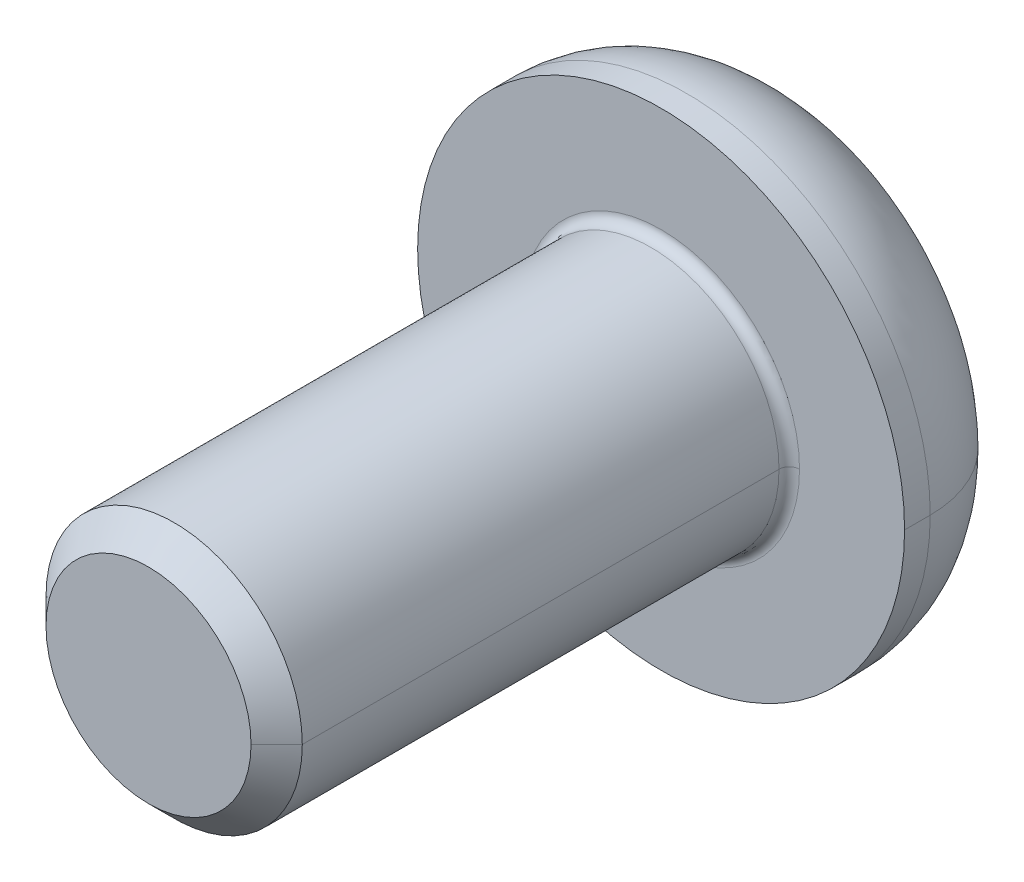
ISO-10303-21;
HEADER;
FILE_DESCRIPTION(('STEP AP214'),'2;1');
FILE_NAME('part.step','',(''),(''),'','','');
FILE_SCHEMA(('AUTOMOTIVE_DESIGN { 1 0 10303 214 1 1 1 1 }'));
ENDSEC;
DATA;
#1=APPLICATION_CONTEXT('core data for automotive mechanical design processes');
#2=APPLICATION_PROTOCOL_DEFINITION('international standard','automotive_design',2000,#1);
#3=PRODUCT_CONTEXT('',#1,'mechanical');
#4=PRODUCT('Part','Part','',(#3));
#5=PRODUCT_RELATED_PRODUCT_CATEGORY('part','',(#4));
#6=PRODUCT_DEFINITION_FORMATION('','',#4);
#7=PRODUCT_DEFINITION_CONTEXT('part definition',#1,'design');
#8=PRODUCT_DEFINITION('design','',#6,#7);
#9=PRODUCT_DEFINITION_SHAPE('','',#8);
#10=(LENGTH_UNIT() NAMED_UNIT(*) SI_UNIT(.MILLI.,.METRE.));
#11=(NAMED_UNIT(*) PLANE_ANGLE_UNIT() SI_UNIT($,.RADIAN.));
#12=(NAMED_UNIT(*) SI_UNIT($,.STERADIAN.) SOLID_ANGLE_UNIT());
#13=UNCERTAINTY_MEASURE_WITH_UNIT(LENGTH_MEASURE(1.E-05),#10,'distance_accuracy_value','');
#14=(GEOMETRIC_REPRESENTATION_CONTEXT(3) GLOBAL_UNCERTAINTY_ASSIGNED_CONTEXT((#13)) GLOBAL_UNIT_ASSIGNED_CONTEXT((#10,
#11,#12)) REPRESENTATION_CONTEXT('',''));
#15=CARTESIAN_POINT('',(0.,0.,0.));
#16=DIRECTION('',(0.,0.,1.));
#17=DIRECTION('',(1.,0.,0.));
#18=AXIS2_PLACEMENT_3D('',#15,#16,#17);
#19=CARTESIAN_POINT('',(0.,0.,0.2));
#20=DIRECTION('',(0.,0.,-1.));
#21=DIRECTION('',(-1.,0.,0.));
#22=AXIS2_PLACEMENT_3D('',#19,#20,#21);
#23=TOROIDAL_SURFACE('',#22,2.7,0.2);
#24=CARTESIAN_POINT('',(2.7,0.,0.2));
#25=DIRECTION('',(0.,1.,0.));
#26=DIRECTION('',(-1.,0.,0.));
#27=AXIS2_PLACEMENT_3D('',#24,#25,#26);
#28=CIRCLE('',#27,0.2);
#29=CARTESIAN_POINT('',(2.7,0.,0.));
#30=VERTEX_POINT('',#29);
#31=CARTESIAN_POINT('',(2.5,0.,0.2));
#32=VERTEX_POINT('',#31);
#33=EDGE_CURVE('E332',#30,#32,#28,.T.);
#34=ORIENTED_EDGE('',*,*,#33,.F.);
#35=CARTESIAN_POINT('',(0.,0.,0.));
#36=DIRECTION('',(0.,0.,-1.));
#37=DIRECTION('',(-1.,0.,0.));
#38=AXIS2_PLACEMENT_3D('',#35,#36,#37);
#39=CIRCLE('',#38,2.7);
#40=CARTESIAN_POINT('',(-2.7,0.,0.));
#41=VERTEX_POINT('',#40);
#42=EDGE_CURVE('E242',#41,#30,#39,.T.);
#43=ORIENTED_EDGE('',*,*,#42,.F.);
#44=CARTESIAN_POINT('',(-2.7,0.,0.2));
#45=DIRECTION('',(0.,-1.,0.));
#46=DIRECTION('',(0.,0.,-1.));
#47=AXIS2_PLACEMENT_3D('',#44,#45,#46);
#48=CIRCLE('',#47,0.2);
#49=CARTESIAN_POINT('',(-2.5,0.,0.2));
#50=VERTEX_POINT('',#49);
#51=EDGE_CURVE('E292',#41,#50,#48,.T.);
#52=ORIENTED_EDGE('',*,*,#51,.T.);
#53=CARTESIAN_POINT('',(0.,0.,0.2));
#54=DIRECTION('',(0.,0.,1.));
#55=DIRECTION('',(-1.,0.,0.));
#56=AXIS2_PLACEMENT_3D('',#53,#54,#55);
#57=CIRCLE('',#56,2.5);
#58=EDGE_CURVE('E200',#32,#50,#57,.T.);
#59=ORIENTED_EDGE('',*,*,#58,.F.);
#60=EDGE_LOOP('',(#34,#43,#52,#59));
#61=FACE_BOUND('',#60,.T.);
#62=ADVANCED_FACE('F18',(#61),#23,.F.);
#63=CARTESIAN_POINT('',(0.,0.,10.));
#64=DIRECTION('',(0.,0.,-1.));
#65=DIRECTION('',(-1.,0.,0.));
#66=AXIS2_PLACEMENT_3D('',#63,#64,#65);
#67=CONICAL_SURFACE('',#66,2.,0.785398163397449);
#68=DIRECTION('',(0.707106781186548,0.,-0.707106781186547));
#69=VECTOR('',#68,1.);
#70=CARTESIAN_POINT('',(2.,0.,10.));
#71=LINE('',#70,#69);
#72=CARTESIAN_POINT('',(2.,0.,10.));
#73=VERTEX_POINT('',#72);
#74=CARTESIAN_POINT('',(2.5,0.,9.5));
#75=VERTEX_POINT('',#74);
#76=EDGE_CURVE('E298',#73,#75,#71,.T.);
#77=ORIENTED_EDGE('',*,*,#76,.F.);
#78=CARTESIAN_POINT('',(0.,0.,10.));
#79=DIRECTION('',(0.,0.,1.));
#80=DIRECTION('',(1.,0.,0.));
#81=AXIS2_PLACEMENT_3D('',#78,#79,#80);
#82=CIRCLE('',#81,2.);
#83=CARTESIAN_POINT('',(-2.,0.,10.));
#84=VERTEX_POINT('',#83);
#85=EDGE_CURVE('E159',#84,#73,#82,.T.);
#86=ORIENTED_EDGE('',*,*,#85,.F.);
#87=DIRECTION('',(-0.707106781186548,0.,-0.707106781186547));
#88=VECTOR('',#87,1.);
#89=CARTESIAN_POINT('',(-2.,0.,10.));
#90=LINE('',#89,#88);
#91=CARTESIAN_POINT('',(-2.5,0.,9.5));
#92=VERTEX_POINT('',#91);
#93=EDGE_CURVE('E181',#84,#92,#90,.T.);
#94=ORIENTED_EDGE('',*,*,#93,.T.);
#95=CARTESIAN_POINT('',(0.,0.,9.5));
#96=DIRECTION('',(0.,0.,-1.));
#97=DIRECTION('',(1.,0.,0.));
#98=AXIS2_PLACEMENT_3D('',#95,#96,#97);
#99=CIRCLE('',#98,2.5);
#100=EDGE_CURVE('E208',#75,#92,#99,.T.);
#101=ORIENTED_EDGE('',*,*,#100,.F.);
#102=EDGE_LOOP('',(#77,#86,#94,#101));
#103=FACE_BOUND('',#102,.T.);
#104=ADVANCED_FACE('F319',(#103),#67,.T.);
#105=CARTESIAN_POINT('',(0.,0.,-0.5));
#106=DIRECTION('',(0.,0.,-1.));
#107=DIRECTION('',(-1.,0.,0.));
#108=AXIS2_PLACEMENT_3D('',#105,#106,#107);
#109=TOROIDAL_SURFACE('',#108,2.5,2.25);
#110=CARTESIAN_POINT('',(2.5,0.,-0.5));
#111=DIRECTION('',(0.,1.,0.));
#112=DIRECTION('',(-1.,0.,0.));
#113=AXIS2_PLACEMENT_3D('',#110,#111,#112);
#114=CIRCLE('',#113,2.25);
#115=CARTESIAN_POINT('',(4.75,0.,-0.5));
#116=VERTEX_POINT('',#115);
#117=CARTESIAN_POINT('',(2.5,0.,-2.75));
#118=VERTEX_POINT('',#117);
#119=EDGE_CURVE('E152',#116,#118,#114,.T.);
#120=ORIENTED_EDGE('',*,*,#119,.F.);
#121=CARTESIAN_POINT('',(0.,0.,-0.5));
#122=DIRECTION('',(0.,0.,1.));
#123=DIRECTION('',(-1.,0.,0.));
#124=AXIS2_PLACEMENT_3D('',#121,#122,#123);
#125=CIRCLE('',#124,4.75);
#126=CARTESIAN_POINT('',(-4.75,0.,-0.5));
#127=VERTEX_POINT('',#126);
#128=EDGE_CURVE('E145',#127,#116,#125,.T.);
#129=ORIENTED_EDGE('',*,*,#128,.F.);
#130=CARTESIAN_POINT('',(-2.5,0.,-0.5));
#131=DIRECTION('',(0.,-1.,0.));
#132=DIRECTION('',(0.,0.,-1.));
#133=AXIS2_PLACEMENT_3D('',#130,#131,#132);
#134=CIRCLE('',#133,2.25);
#135=CARTESIAN_POINT('',(-2.5,0.,-2.75));
#136=VERTEX_POINT('',#135);
#137=EDGE_CURVE('E149',#127,#136,#134,.T.);
#138=ORIENTED_EDGE('',*,*,#137,.T.);
#139=CARTESIAN_POINT('',(0.,0.,-2.75));
#140=DIRECTION('',(0.,0.,-1.));
#141=DIRECTION('',(-1.,0.,0.));
#142=AXIS2_PLACEMENT_3D('',#139,#140,#141);
#143=CIRCLE('',#142,2.5);
#144=EDGE_CURVE('E215',#118,#136,#143,.T.);
#145=ORIENTED_EDGE('',*,*,#144,.F.);
#146=EDGE_LOOP('',(#120,#129,#138,#145));
#147=FACE_BOUND('',#146,.T.);
#148=ADVANCED_FACE('F147',(#147),#109,.T.);
#149=CARTESIAN_POINT('',(0.,0.,-1.19));
#150=DIRECTION('',(0.,0.,-1.));
#151=DIRECTION('',(0.,-1.,0.));
#152=AXIS2_PLACEMENT_3D('',#149,#150,#151);
#153=PLANE('',#152);
#154=DIRECTION('',(-1.,0.,0.));
#155=VECTOR('',#154,1.);
#156=CARTESIAN_POINT('',(0.866025403784439,-1.5,-1.19));
#157=LINE('',#156,#155);
#158=CARTESIAN_POINT('',(0.866025403784439,-1.5,-1.19));
#159=VERTEX_POINT('',#158);
#160=CARTESIAN_POINT('',(-0.866025403784439,-1.5,-1.19));
#161=VERTEX_POINT('',#160);
#162=EDGE_CURVE('E246',#159,#161,#157,.T.);
#163=ORIENTED_EDGE('',*,*,#162,.T.);
#164=DIRECTION('',(-0.5,0.866025403784439,0.));
#165=VECTOR('',#164,1.);
#166=CARTESIAN_POINT('',(-0.866025403784439,-1.5,-1.19));
#167=LINE('',#166,#165);
#168=CARTESIAN_POINT('',(-1.73205080756888,0.,-1.19));
#169=VERTEX_POINT('',#168);
#170=EDGE_CURVE('E11',#161,#169,#167,.T.);
#171=ORIENTED_EDGE('',*,*,#170,.T.);
#172=DIRECTION('',(0.5,0.866025403784439,0.));
#173=VECTOR('',#172,1.);
#174=CARTESIAN_POINT('',(-1.73205080756888,0.,-1.19));
#175=LINE('',#174,#173);
#176=CARTESIAN_POINT('',(-0.86602540378444,1.5,-1.19));
#177=VERTEX_POINT('',#176);
#178=EDGE_CURVE('E45',#169,#177,#175,.T.);
#179=ORIENTED_EDGE('',*,*,#178,.T.);
#180=DIRECTION('',(1.,0.,0.));
#181=VECTOR('',#180,1.);
#182=CARTESIAN_POINT('',(-0.86602540378444,1.5,-1.19));
#183=LINE('',#182,#181);
#184=CARTESIAN_POINT('',(0.866025403784439,1.5,-1.19));
#185=VERTEX_POINT('',#184);
#186=EDGE_CURVE('E198',#177,#185,#183,.T.);
#187=ORIENTED_EDGE('',*,*,#186,.T.);
#188=DIRECTION('',(0.5,-0.866025403784439,0.));
#189=VECTOR('',#188,1.);
#190=CARTESIAN_POINT('',(0.866025403784439,1.5,-1.19));
#191=LINE('',#190,#189);
#192=CARTESIAN_POINT('',(1.73205080756888,0.,-1.19));
#193=VERTEX_POINT('',#192);
#194=EDGE_CURVE('E199',#185,#193,#191,.T.);
#195=ORIENTED_EDGE('',*,*,#194,.T.);
#196=DIRECTION('',(-0.5,-0.866025403784439,0.));
#197=VECTOR('',#196,1.);
#198=CARTESIAN_POINT('',(1.73205080756888,0.,-1.19));
#199=LINE('',#198,#197);
#200=EDGE_CURVE('E252',#193,#159,#199,.T.);
#201=ORIENTED_EDGE('',*,*,#200,.T.);
#202=EDGE_LOOP('',(#163,#171,#179,#187,#195,#201));
#203=FACE_BOUND('',#202,.T.);
#204=ADVANCED_FACE('F625',(#203),#153,.T.);
#205=CARTESIAN_POINT('',(-0.866025403784439,-1.5,-1.19));
#206=DIRECTION('',(-0.866025403784439,-0.5,0.));
#207=DIRECTION('',(-0.5,0.866025403784439,0.));
#208=AXIS2_PLACEMENT_3D('',#205,#206,#207);
#209=PLANE('',#208);
#210=DIRECTION('',(-0.5,0.866025403784439,0.));
#211=VECTOR('',#210,1.);
#212=CARTESIAN_POINT('',(-0.866025403784439,-1.5,-2.75));
#213=LINE('',#212,#211);
#214=CARTESIAN_POINT('',(-0.866025403784439,-1.5,-2.75));
#215=VERTEX_POINT('',#214);
#216=CARTESIAN_POINT('',(-1.73205080756888,0.,-2.75));
#217=VERTEX_POINT('',#216);
#218=EDGE_CURVE('E238',#215,#217,#213,.T.);
#219=ORIENTED_EDGE('',*,*,#218,.T.);
#220=DIRECTION('',(0.,0.,-1.));
#221=VECTOR('',#220,1.);
#222=CARTESIAN_POINT('',(-1.73205080756888,0.,-1.19));
#223=LINE('',#222,#221);
#224=EDGE_CURVE('E26',#169,#217,#223,.T.);
#225=ORIENTED_EDGE('',*,*,#224,.F.);
#226=ORIENTED_EDGE('',*,*,#170,.F.);
#227=DIRECTION('',(0.,0.,-1.));
#228=VECTOR('',#227,1.);
#229=CARTESIAN_POINT('',(-0.866025403784439,-1.5,-1.19));
#230=LINE('',#229,#228);
#231=EDGE_CURVE('E245',#161,#215,#230,.T.);
#232=ORIENTED_EDGE('',*,*,#231,.T.);
#233=EDGE_LOOP('',(#219,#225,#226,#232));
#234=FACE_BOUND('',#233,.T.);
#235=ADVANCED_FACE('F273',(#234),#209,.F.);
#236=CARTESIAN_POINT('',(-1.73205080756888,0.,-1.19));
#237=DIRECTION('',(-0.866025403784439,0.5,0.));
#238=DIRECTION('',(0.,0.,1.));
#239=AXIS2_PLACEMENT_3D('',#236,#237,#238);
#240=PLANE('',#239);
#241=DIRECTION('',(0.5,0.866025403784439,0.));
#242=VECTOR('',#241,1.);
#243=CARTESIAN_POINT('',(-1.73205080756888,0.,-2.75));
#244=LINE('',#243,#242);
#245=CARTESIAN_POINT('',(-0.86602540378444,1.5,-2.75));
#246=VERTEX_POINT('',#245);
#247=EDGE_CURVE('E234',#217,#246,#244,.T.);
#248=ORIENTED_EDGE('',*,*,#247,.T.);
#249=DIRECTION('',(0.,0.,-1.));
#250=VECTOR('',#249,1.);
#251=CARTESIAN_POINT('',(-0.86602540378444,1.5,-1.19));
#252=LINE('',#251,#250);
#253=EDGE_CURVE('E262',#177,#246,#252,.T.);
#254=ORIENTED_EDGE('',*,*,#253,.F.);
#255=ORIENTED_EDGE('',*,*,#178,.F.);
#256=ORIENTED_EDGE('',*,*,#224,.T.);
#257=EDGE_LOOP('',(#248,#254,#255,#256));
#258=FACE_BOUND('',#257,.T.);
#259=ADVANCED_FACE('F268',(#258),#240,.F.);
#260=CARTESIAN_POINT('',(-0.86602540378444,1.5,-1.19));
#261=DIRECTION('',(0.,1.,0.));
#262=DIRECTION('',(1.,0.,0.));
#263=AXIS2_PLACEMENT_3D('',#260,#261,#262);
#264=PLANE('',#263);
#265=DIRECTION('',(1.,0.,0.));
#266=VECTOR('',#265,1.);
#267=CARTESIAN_POINT('',(-0.86602540378444,1.5,-2.75));
#268=LINE('',#267,#266);
#269=CARTESIAN_POINT('',(0.866025403784439,1.5,-2.75));
#270=VERTEX_POINT('',#269);
#271=EDGE_CURVE('E230',#246,#270,#268,.T.);
#272=ORIENTED_EDGE('',*,*,#271,.T.);
#273=DIRECTION('',(0.,0.,-1.));
#274=VECTOR('',#273,1.);
#275=CARTESIAN_POINT('',(0.866025403784439,1.5,-1.19));
#276=LINE('',#275,#274);
#277=EDGE_CURVE('E195',#185,#270,#276,.T.);
#278=ORIENTED_EDGE('',*,*,#277,.F.);
#279=ORIENTED_EDGE('',*,*,#186,.F.);
#280=ORIENTED_EDGE('',*,*,#253,.T.);
#281=EDGE_LOOP('',(#272,#278,#279,#280));
#282=FACE_BOUND('',#281,.T.);
#283=ADVANCED_FACE('F283',(#282),#264,.F.);
#284=CARTESIAN_POINT('',(0.866025403784439,1.5,-1.19));
#285=DIRECTION('',(0.866025403784439,0.5,0.));
#286=DIRECTION('',(0.,0.,-1.));
#287=AXIS2_PLACEMENT_3D('',#284,#285,#286);
#288=PLANE('',#287);
#289=DIRECTION('',(0.5,-0.866025403784439,0.));
#290=VECTOR('',#289,1.);
#291=CARTESIAN_POINT('',(0.866025403784439,1.5,-2.75));
#292=LINE('',#291,#290);
#293=CARTESIAN_POINT('',(1.73205080756888,0.,-2.75));
#294=VERTEX_POINT('',#293);
#295=EDGE_CURVE('E223',#270,#294,#292,.T.);
#296=ORIENTED_EDGE('',*,*,#295,.T.);
#297=DIRECTION('',(0.,0.,-1.));
#298=VECTOR('',#297,1.);
#299=CARTESIAN_POINT('',(1.73205080756888,0.,-1.19));
#300=LINE('',#299,#298);
#301=EDGE_CURVE('E255',#193,#294,#300,.T.);
#302=ORIENTED_EDGE('',*,*,#301,.F.);
#303=ORIENTED_EDGE('',*,*,#194,.F.);
#304=ORIENTED_EDGE('',*,*,#277,.T.);
#305=EDGE_LOOP('',(#296,#302,#303,#304));
#306=FACE_BOUND('',#305,.T.);
#307=ADVANCED_FACE('F649',(#306),#288,.F.);
#308=CARTESIAN_POINT('',(1.73205080756888,0.,-1.19));
#309=DIRECTION('',(0.866025403784439,-0.5,0.));
#310=DIRECTION('',(0.,0.,-1.));
#311=AXIS2_PLACEMENT_3D('',#308,#309,#310);
#312=PLANE('',#311);
#313=DIRECTION('',(-0.5,-0.866025403784439,0.));
#314=VECTOR('',#313,1.);
#315=CARTESIAN_POINT('',(1.73205080756888,0.,-2.75));
#316=LINE('',#315,#314);
#317=CARTESIAN_POINT('',(0.866025403784439,-1.5,-2.75));
#318=VERTEX_POINT('',#317);
#319=EDGE_CURVE('E219',#294,#318,#316,.T.);
#320=ORIENTED_EDGE('',*,*,#319,.T.);
#321=DIRECTION('',(0.,0.,-1.));
#322=VECTOR('',#321,1.);
#323=CARTESIAN_POINT('',(0.866025403784439,-1.5,-1.19));
#324=LINE('',#323,#322);
#325=EDGE_CURVE('E249',#159,#318,#324,.T.);
#326=ORIENTED_EDGE('',*,*,#325,.F.);
#327=ORIENTED_EDGE('',*,*,#200,.F.);
#328=ORIENTED_EDGE('',*,*,#301,.T.);
#329=EDGE_LOOP('',(#320,#326,#327,#328));
#330=FACE_BOUND('',#329,.T.);
#331=ADVANCED_FACE('F644',(#330),#312,.F.);
#332=CARTESIAN_POINT('',(0.866025403784439,-1.5,-1.19));
#333=DIRECTION('',(0.,-1.,0.));
#334=DIRECTION('',(-1.,0.,0.));
#335=AXIS2_PLACEMENT_3D('',#332,#333,#334);
#336=PLANE('',#335);
#337=DIRECTION('',(-1.,0.,0.));
#338=VECTOR('',#337,1.);
#339=CARTESIAN_POINT('',(0.866025403784439,-1.5,-2.75));
#340=LINE('',#339,#338);
#341=EDGE_CURVE('E218',#318,#215,#340,.T.);
#342=ORIENTED_EDGE('',*,*,#341,.T.);
#343=ORIENTED_EDGE('',*,*,#231,.F.);
#344=ORIENTED_EDGE('',*,*,#162,.F.);
#345=ORIENTED_EDGE('',*,*,#325,.T.);
#346=EDGE_LOOP('',(#342,#343,#344,#345));
#347=FACE_BOUND('',#346,.T.);
#348=ADVANCED_FACE('F648',(#347),#336,.F.);
#349=CARTESIAN_POINT('',(0.,0.,0.));
#350=DIRECTION('',(0.,0.,-1.));
#351=DIRECTION('',(0.,-1.,0.));
#352=AXIS2_PLACEMENT_3D('',#349,#350,#351);
#353=PLANE('',#352);
#354=ORIENTED_EDGE('',*,*,#42,.T.);
#355=CARTESIAN_POINT('',(0.,0.,0.));
#356=DIRECTION('',(0.,0.,-1.));
#357=DIRECTION('',(-1.,0.,0.));
#358=AXIS2_PLACEMENT_3D('',#355,#356,#357);
#359=CIRCLE('',#358,2.7);
#360=EDGE_CURVE('E340',#30,#41,#359,.T.);
#361=ORIENTED_EDGE('',*,*,#360,.T.);
#362=EDGE_LOOP('',(#354,#361));
#363=FACE_BOUND('',#362,.T.);
#364=CARTESIAN_POINT('',(0.,0.,0.));
#365=DIRECTION('',(0.,0.,-1.));
#366=DIRECTION('',(-1.,0.,0.));
#367=AXIS2_PLACEMENT_3D('',#364,#365,#366);
#368=CIRCLE('',#367,4.75);
#369=CARTESIAN_POINT('',(4.75,0.,0.));
#370=VERTEX_POINT('',#369);
#371=CARTESIAN_POINT('',(-4.75,0.,0.));
#372=VERTEX_POINT('',#371);
#373=EDGE_CURVE('E158',#370,#372,#368,.T.);
#374=ORIENTED_EDGE('',*,*,#373,.F.);
#375=CARTESIAN_POINT('',(0.,0.,0.));
#376=DIRECTION('',(0.,0.,-1.));
#377=DIRECTION('',(-1.,0.,0.));
#378=AXIS2_PLACEMENT_3D('',#375,#376,#377);
#379=CIRCLE('',#378,4.75);
#380=EDGE_CURVE('E169',#372,#370,#379,.T.);
#381=ORIENTED_EDGE('',*,*,#380,.F.);
#382=EDGE_LOOP('',(#374,#381));
#383=FACE_BOUND('',#382,.T.);
#384=ADVANCED_FACE('F609',(#363,#383),#353,.F.);
#385=CARTESIAN_POINT('',(0.,0.,-2.75));
#386=DIRECTION('',(0.,0.,-1.));
#387=DIRECTION('',(0.,-1.,0.));
#388=AXIS2_PLACEMENT_3D('',#385,#386,#387);
#389=PLANE('',#388);
#390=ORIENTED_EDGE('',*,*,#341,.F.);
#391=ORIENTED_EDGE('',*,*,#319,.F.);
#392=ORIENTED_EDGE('',*,*,#295,.F.);
#393=ORIENTED_EDGE('',*,*,#271,.F.);
#394=ORIENTED_EDGE('',*,*,#247,.F.);
#395=ORIENTED_EDGE('',*,*,#218,.F.);
#396=EDGE_LOOP('',(#390,#391,#392,#393,#394,#395));
#397=FACE_BOUND('',#396,.T.);
#398=CARTESIAN_POINT('',(0.,0.,-2.75));
#399=DIRECTION('',(0.,0.,-1.));
#400=DIRECTION('',(-1.,0.,0.));
#401=AXIS2_PLACEMENT_3D('',#398,#399,#400);
#402=CIRCLE('',#401,2.5);
#403=EDGE_CURVE('E175',#136,#118,#402,.T.);
#404=ORIENTED_EDGE('',*,*,#403,.T.);
#405=ORIENTED_EDGE('',*,*,#144,.T.);
#406=EDGE_LOOP('',(#404,#405));
#407=FACE_BOUND('',#406,.T.);
#408=ADVANCED_FACE('F277',(#397,#407),#389,.T.);
#409=CARTESIAN_POINT('',(0.,0.,-2.75));
#410=DIRECTION('',(0.,0.,1.));
#411=DIRECTION('',(1.,0.,0.));
#412=AXIS2_PLACEMENT_3D('',#409,#410,#411);
#413=CYLINDRICAL_SURFACE('',#412,4.75);
#414=DIRECTION('',(0.,0.,1.));
#415=VECTOR('',#414,1.);
#416=CARTESIAN_POINT('',(-4.75,0.,-2.75));
#417=LINE('',#416,#415);
#418=EDGE_CURVE('E162',#127,#372,#417,.T.);
#419=ORIENTED_EDGE('',*,*,#418,.F.);
#420=ORIENTED_EDGE('',*,*,#128,.T.);
#421=DIRECTION('',(0.,0.,1.));
#422=VECTOR('',#421,1.);
#423=CARTESIAN_POINT('',(4.75,0.,-2.75));
#424=LINE('',#423,#422);
#425=EDGE_CURVE('E179',#116,#370,#424,.T.);
#426=ORIENTED_EDGE('',*,*,#425,.T.);
#427=ORIENTED_EDGE('',*,*,#373,.T.);
#428=EDGE_LOOP('',(#419,#420,#426,#427));
#429=FACE_BOUND('',#428,.T.);
#430=ADVANCED_FACE('F163',(#429),#413,.T.);
#431=CARTESIAN_POINT('',(0.,0.,10.));
#432=DIRECTION('',(0.,0.,1.));
#433=DIRECTION('',(1.,0.,0.));
#434=AXIS2_PLACEMENT_3D('',#431,#432,#433);
#435=PLANE('',#434);
#436=ORIENTED_EDGE('',*,*,#85,.T.);
#437=CARTESIAN_POINT('',(0.,0.,10.));
#438=DIRECTION('',(0.,0.,1.));
#439=DIRECTION('',(1.,0.,0.));
#440=AXIS2_PLACEMENT_3D('',#437,#438,#439);
#441=CIRCLE('',#440,2.);
#442=EDGE_CURVE('E294',#73,#84,#441,.T.);
#443=ORIENTED_EDGE('',*,*,#442,.T.);
#444=EDGE_LOOP('',(#436,#443));
#445=FACE_BOUND('',#444,.T.);
#446=ADVANCED_FACE('F567',(#445),#435,.T.);
#447=CARTESIAN_POINT('',(0.,0.,10.));
#448=DIRECTION('',(0.,0.,-1.));
#449=DIRECTION('',(-1.,0.,0.));
#450=AXIS2_PLACEMENT_3D('',#447,#448,#449);
#451=CYLINDRICAL_SURFACE('',#450,2.5);
#452=DIRECTION('',(0.,0.,-1.));
#453=VECTOR('',#452,1.);
#454=CARTESIAN_POINT('',(2.5,0.,10.));
#455=LINE('',#454,#453);
#456=EDGE_CURVE('E205',#75,#32,#455,.T.);
#457=ORIENTED_EDGE('',*,*,#456,.F.);
#458=ORIENTED_EDGE('',*,*,#100,.T.);
#459=DIRECTION('',(0.,0.,-1.));
#460=VECTOR('',#459,1.);
#461=CARTESIAN_POINT('',(-2.5,0.,10.));
#462=LINE('',#461,#460);
#463=EDGE_CURVE('E204',#92,#50,#462,.T.);
#464=ORIENTED_EDGE('',*,*,#463,.T.);
#465=CARTESIAN_POINT('',(0.,0.,0.2));
#466=DIRECTION('',(0.,0.,1.));
#467=DIRECTION('',(-1.,0.,0.));
#468=AXIS2_PLACEMENT_3D('',#465,#466,#467);
#469=CIRCLE('',#468,2.5);
#470=EDGE_CURVE('E323',#50,#32,#469,.T.);
#471=ORIENTED_EDGE('',*,*,#470,.T.);
#472=EDGE_LOOP('',(#457,#458,#464,#471));
#473=FACE_BOUND('',#472,.T.);
#474=ADVANCED_FACE('F321',(#473),#451,.T.);
#475=CARTESIAN_POINT('',(0.,0.,10.));
#476=DIRECTION('',(0.,0.,-1.));
#477=DIRECTION('',(-1.,0.,0.));
#478=AXIS2_PLACEMENT_3D('',#475,#476,#477);
#479=CYLINDRICAL_SURFACE('',#478,2.5);
#480=CARTESIAN_POINT('',(0.,0.,9.5));
#481=DIRECTION('',(0.,0.,-1.));
#482=DIRECTION('',(1.,0.,0.));
#483=AXIS2_PLACEMENT_3D('',#480,#481,#482);
#484=CIRCLE('',#483,2.5);
#485=EDGE_CURVE('E190',#92,#75,#484,.T.);
#486=ORIENTED_EDGE('',*,*,#485,.T.);
#487=ORIENTED_EDGE('',*,*,#456,.T.);
#488=ORIENTED_EDGE('',*,*,#58,.T.);
#489=ORIENTED_EDGE('',*,*,#463,.F.);
#490=EDGE_LOOP('',(#486,#487,#488,#489));
#491=FACE_BOUND('',#490,.T.);
#492=ADVANCED_FACE('F310',(#491),#479,.T.);
#493=CARTESIAN_POINT('',(0.,0.,-2.75));
#494=DIRECTION('',(0.,0.,1.));
#495=DIRECTION('',(1.,0.,0.));
#496=AXIS2_PLACEMENT_3D('',#493,#494,#495);
#497=CYLINDRICAL_SURFACE('',#496,4.75);
#498=CARTESIAN_POINT('',(0.,0.,-0.5));
#499=DIRECTION('',(0.,0.,1.));
#500=DIRECTION('',(-1.,0.,0.));
#501=AXIS2_PLACEMENT_3D('',#498,#499,#500);
#502=CIRCLE('',#501,4.75);
#503=EDGE_CURVE('E173',#116,#127,#502,.T.);
#504=ORIENTED_EDGE('',*,*,#503,.T.);
#505=ORIENTED_EDGE('',*,*,#418,.T.);
#506=ORIENTED_EDGE('',*,*,#380,.T.);
#507=ORIENTED_EDGE('',*,*,#425,.F.);
#508=EDGE_LOOP('',(#504,#505,#506,#507));
#509=FACE_BOUND('',#508,.T.);
#510=ADVANCED_FACE('F178',(#509),#497,.T.);
#511=CARTESIAN_POINT('',(0.,0.,-0.5));
#512=DIRECTION('',(0.,0.,-1.));
#513=DIRECTION('',(-1.,0.,0.));
#514=AXIS2_PLACEMENT_3D('',#511,#512,#513);
#515=TOROIDAL_SURFACE('',#514,2.5,2.25);
#516=ORIENTED_EDGE('',*,*,#503,.F.);
#517=ORIENTED_EDGE('',*,*,#119,.T.);
#518=ORIENTED_EDGE('',*,*,#403,.F.);
#519=ORIENTED_EDGE('',*,*,#137,.F.);
#520=EDGE_LOOP('',(#516,#517,#518,#519));
#521=FACE_BOUND('',#520,.T.);
#522=ADVANCED_FACE('F172',(#521),#515,.T.);
#523=CARTESIAN_POINT('',(0.,0.,10.));
#524=DIRECTION('',(0.,0.,-1.));
#525=DIRECTION('',(-1.,0.,0.));
#526=AXIS2_PLACEMENT_3D('',#523,#524,#525);
#527=CONICAL_SURFACE('',#526,2.,0.785398163397449);
#528=ORIENTED_EDGE('',*,*,#442,.F.);
#529=ORIENTED_EDGE('',*,*,#76,.T.);
#530=ORIENTED_EDGE('',*,*,#485,.F.);
#531=ORIENTED_EDGE('',*,*,#93,.F.);
#532=EDGE_LOOP('',(#528,#529,#530,#531));
#533=FACE_BOUND('',#532,.T.);
#534=ADVANCED_FACE('F317',(#533),#527,.T.);
#535=CARTESIAN_POINT('',(0.,0.,0.2));
#536=DIRECTION('',(0.,0.,-1.));
#537=DIRECTION('',(-1.,0.,0.));
#538=AXIS2_PLACEMENT_3D('',#535,#536,#537);
#539=TOROIDAL_SURFACE('',#538,2.7,0.2);
#540=ORIENTED_EDGE('',*,*,#360,.F.);
#541=ORIENTED_EDGE('',*,*,#33,.T.);
#542=ORIENTED_EDGE('',*,*,#470,.F.);
#543=ORIENTED_EDGE('',*,*,#51,.F.);
#544=EDGE_LOOP('',(#540,#541,#542,#543));
#545=FACE_BOUND('',#544,.T.);
#546=ADVANCED_FACE('F555',(#545),#539,.F.);
#547=CLOSED_SHELL('',(#62,#104,#148,#204,#235,#259,#283,#307,#331,#348,#384,#408,#430,#446,#474,
#492,#510,#522,#534,#546));
#548=MANIFOLD_SOLID_BREP('B1',#547);
#549=ADVANCED_BREP_SHAPE_REPRESENTATION('',(#18,#548),#14);
#550=SHAPE_DEFINITION_REPRESENTATION(#9,#549);
ENDSEC;
END-ISO-10303-21;
